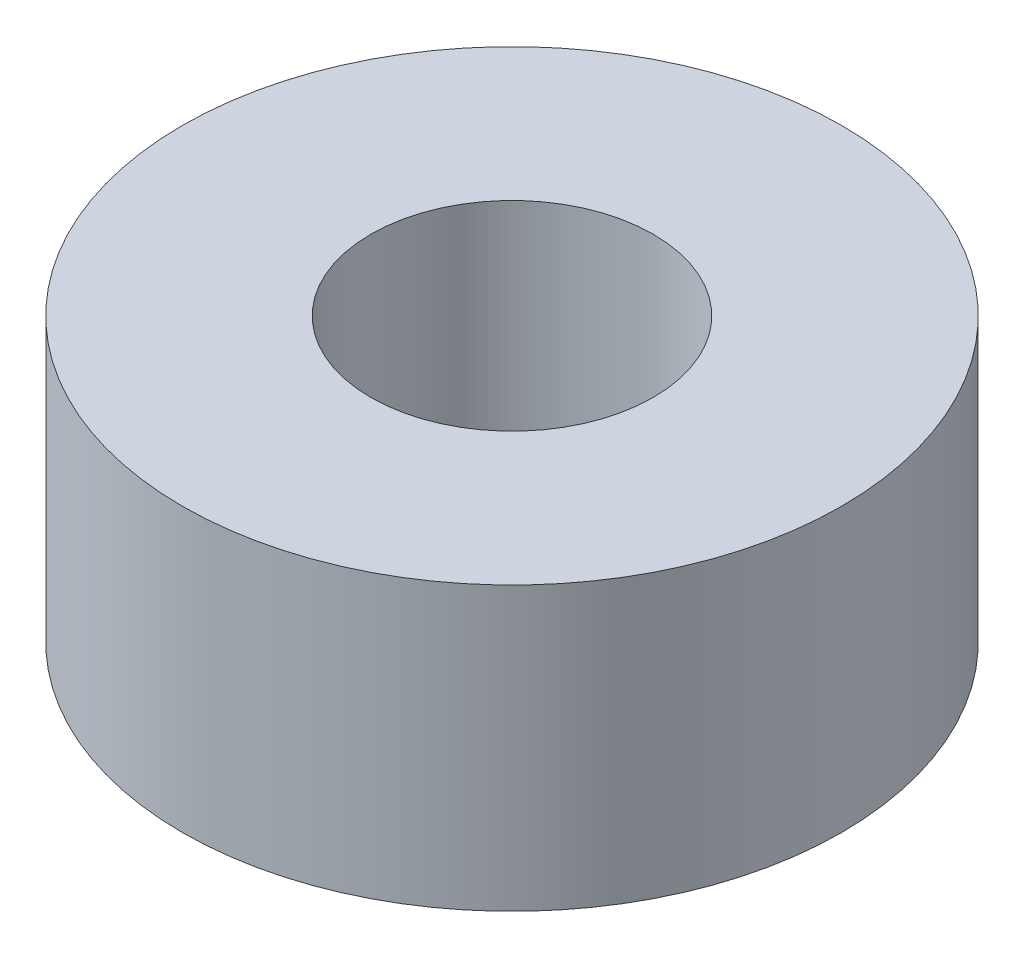
ISO-10303-21;
HEADER;
FILE_DESCRIPTION(('STEP AP214'),'2;1');
FILE_NAME('part.step','',(''),(''),'','','');
FILE_SCHEMA(('AUTOMOTIVE_DESIGN { 1 0 10303 214 1 1 1 1 }'));
ENDSEC;
DATA;
#1=APPLICATION_CONTEXT('core data for automotive mechanical design processes');
#2=APPLICATION_PROTOCOL_DEFINITION('international standard','automotive_design',2000,#1);
#3=PRODUCT_CONTEXT('',#1,'mechanical');
#4=PRODUCT('Part','Part','',(#3));
#5=PRODUCT_RELATED_PRODUCT_CATEGORY('part','',(#4));
#6=PRODUCT_DEFINITION_FORMATION('','',#4);
#7=PRODUCT_DEFINITION_CONTEXT('part definition',#1,'design');
#8=PRODUCT_DEFINITION('design','',#6,#7);
#9=PRODUCT_DEFINITION_SHAPE('','',#8);
#10=(LENGTH_UNIT() NAMED_UNIT(*) SI_UNIT(.MILLI.,.METRE.));
#11=(NAMED_UNIT(*) PLANE_ANGLE_UNIT() SI_UNIT($,.RADIAN.));
#12=(NAMED_UNIT(*) SI_UNIT($,.STERADIAN.) SOLID_ANGLE_UNIT());
#13=UNCERTAINTY_MEASURE_WITH_UNIT(LENGTH_MEASURE(1.E-05),#10,'distance_accuracy_value','');
#14=(GEOMETRIC_REPRESENTATION_CONTEXT(3) GLOBAL_UNCERTAINTY_ASSIGNED_CONTEXT((#13)) GLOBAL_UNIT_ASSIGNED_CONTEXT((#10,
#11,#12)) REPRESENTATION_CONTEXT('',''));
#15=CARTESIAN_POINT('',(0.,0.,0.));
#16=DIRECTION('',(0.,0.,1.));
#17=DIRECTION('',(1.,0.,0.));
#18=AXIS2_PLACEMENT_3D('',#15,#16,#17);
#19=CARTESIAN_POINT('',(0.,9.525,0.));
#20=DIRECTION('',(0.,1.,0.));
#21=DIRECTION('',(0.,0.,1.));
#22=AXIS2_PLACEMENT_3D('',#19,#20,#21);
#23=PLANE('',#22);
#24=CARTESIAN_POINT('',(0.,9.525,0.));
#25=DIRECTION('',(0.,1.,0.));
#26=DIRECTION('',(0.,0.,1.));
#27=AXIS2_PLACEMENT_3D('',#24,#25,#26);
#28=CIRCLE('',#27,11.1125);
#29=CARTESIAN_POINT('',(0.,9.525,11.1125));
#30=VERTEX_POINT('',#29);
#31=EDGE_CURVE('E10',#30,#30,#28,.T.);
#32=ORIENTED_EDGE('',*,*,#31,.T.);
#33=EDGE_LOOP('',(#32));
#34=FACE_BOUND('',#33,.T.);
#35=CARTESIAN_POINT('',(0.,9.525,0.));
#36=DIRECTION('',(0.,1.,0.));
#37=DIRECTION('',(0.,0.,1.));
#38=AXIS2_PLACEMENT_3D('',#35,#36,#37);
#39=CIRCLE('',#38,4.7625);
#40=CARTESIAN_POINT('',(0.,9.525,4.7625));
#41=VERTEX_POINT('',#40);
#42=EDGE_CURVE('E40',#41,#41,#39,.T.);
#43=ORIENTED_EDGE('',*,*,#42,.F.);
#44=EDGE_LOOP('',(#43));
#45=FACE_BOUND('',#44,.T.);
#46=ADVANCED_FACE('F29',(#34,#45),#23,.T.);
#47=CARTESIAN_POINT('',(0.,0.,0.));
#48=DIRECTION('',(0.,1.,0.));
#49=DIRECTION('',(0.,0.,1.));
#50=AXIS2_PLACEMENT_3D('',#47,#48,#49);
#51=PLANE('',#50);
#52=CARTESIAN_POINT('',(0.,0.,0.));
#53=DIRECTION('',(0.,1.,0.));
#54=DIRECTION('',(0.,0.,1.));
#55=AXIS2_PLACEMENT_3D('',#52,#53,#54);
#56=CIRCLE('',#55,11.1125);
#57=CARTESIAN_POINT('',(0.,0.,11.1125));
#58=VERTEX_POINT('',#57);
#59=EDGE_CURVE('E33',#58,#58,#56,.T.);
#60=ORIENTED_EDGE('',*,*,#59,.F.);
#61=EDGE_LOOP('',(#60));
#62=FACE_BOUND('',#61,.T.);
#63=CARTESIAN_POINT('',(0.,0.,0.));
#64=DIRECTION('',(0.,1.,0.));
#65=DIRECTION('',(0.,0.,1.));
#66=AXIS2_PLACEMENT_3D('',#63,#64,#65);
#67=CIRCLE('',#66,4.7625);
#68=CARTESIAN_POINT('',(0.,0.,4.7625));
#69=VERTEX_POINT('',#68);
#70=EDGE_CURVE('E42',#69,#69,#67,.T.);
#71=ORIENTED_EDGE('',*,*,#70,.T.);
#72=EDGE_LOOP('',(#71));
#73=FACE_BOUND('',#72,.T.);
#74=ADVANCED_FACE('F52',(#62,#73),#51,.F.);
#75=CARTESIAN_POINT('',(0.,9.525,0.));
#76=DIRECTION('',(0.,-1.,0.));
#77=DIRECTION('',(0.,0.,-1.));
#78=AXIS2_PLACEMENT_3D('',#75,#76,#77);
#79=CYLINDRICAL_SURFACE('',#78,11.1125);
#80=ORIENTED_EDGE('',*,*,#31,.F.);
#81=EDGE_LOOP('',(#80));
#82=FACE_BOUND('',#81,.T.);
#83=ORIENTED_EDGE('',*,*,#59,.T.);
#84=EDGE_LOOP('',(#83));
#85=FACE_BOUND('',#84,.T.);
#86=ADVANCED_FACE('F31',(#82,#85),#79,.T.);
#87=CARTESIAN_POINT('',(0.,9.525,0.));
#88=DIRECTION('',(0.,-1.,0.));
#89=DIRECTION('',(0.,0.,-1.));
#90=AXIS2_PLACEMENT_3D('',#87,#88,#89);
#91=CYLINDRICAL_SURFACE('',#90,4.7625);
#92=ORIENTED_EDGE('',*,*,#42,.T.);
#93=EDGE_LOOP('',(#92));
#94=FACE_BOUND('',#93,.T.);
#95=ORIENTED_EDGE('',*,*,#70,.F.);
#96=EDGE_LOOP('',(#95));
#97=FACE_BOUND('',#96,.T.);
#98=ADVANCED_FACE('F48',(#94,#97),#91,.F.);
#99=CLOSED_SHELL('',(#46,#74,#86,#98));
#100=MANIFOLD_SOLID_BREP('B2',#99);
#101=ADVANCED_BREP_SHAPE_REPRESENTATION('',(#18,#100),#14);
#102=SHAPE_DEFINITION_REPRESENTATION(#9,#101);
ENDSEC;
END-ISO-10303-21;
